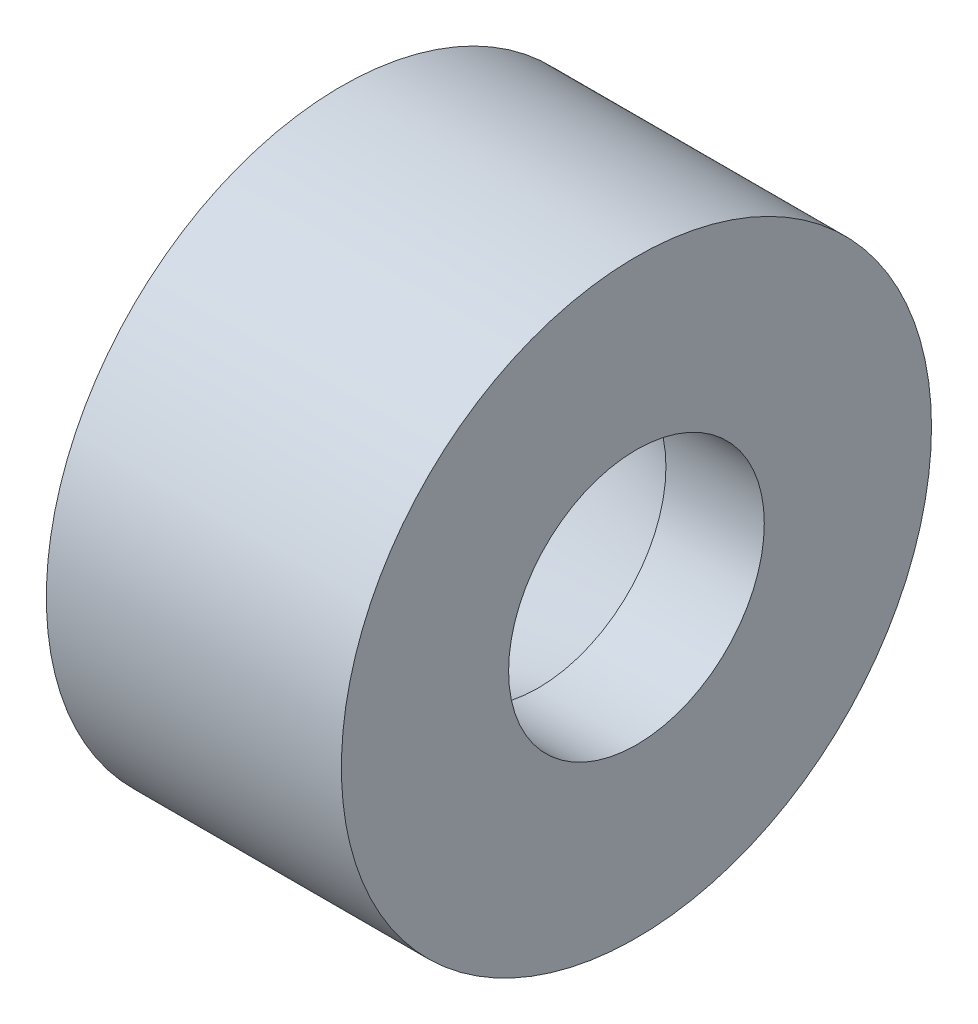
ISO-10303-21;
HEADER;
FILE_DESCRIPTION(('STEP AP214'),'2;1');
FILE_NAME('part.step','',(''),(''),'','','');
FILE_SCHEMA(('AUTOMOTIVE_DESIGN { 1 0 10303 214 1 1 1 1 }'));
ENDSEC;
DATA;
#1=APPLICATION_CONTEXT('core data for automotive mechanical design processes');
#2=APPLICATION_PROTOCOL_DEFINITION('international standard','automotive_design',2000,#1);
#3=PRODUCT_CONTEXT('',#1,'mechanical');
#4=PRODUCT('Part','Part','',(#3));
#5=PRODUCT_RELATED_PRODUCT_CATEGORY('part','',(#4));
#6=PRODUCT_DEFINITION_FORMATION('','',#4);
#7=PRODUCT_DEFINITION_CONTEXT('part definition',#1,'design');
#8=PRODUCT_DEFINITION('design','',#6,#7);
#9=PRODUCT_DEFINITION_SHAPE('','',#8);
#10=(LENGTH_UNIT() NAMED_UNIT(*) SI_UNIT(.MILLI.,.METRE.));
#11=(NAMED_UNIT(*) PLANE_ANGLE_UNIT() SI_UNIT($,.RADIAN.));
#12=(NAMED_UNIT(*) SI_UNIT($,.STERADIAN.) SOLID_ANGLE_UNIT());
#13=UNCERTAINTY_MEASURE_WITH_UNIT(LENGTH_MEASURE(1.E-05),#10,'distance_accuracy_value','');
#14=(GEOMETRIC_REPRESENTATION_CONTEXT(3) GLOBAL_UNCERTAINTY_ASSIGNED_CONTEXT((#13)) GLOBAL_UNIT_ASSIGNED_CONTEXT((#10,
#11,#12)) REPRESENTATION_CONTEXT('',''));
#15=CARTESIAN_POINT('',(0.,0.,0.));
#16=DIRECTION('',(0.,0.,1.));
#17=DIRECTION('',(1.,0.,0.));
#18=AXIS2_PLACEMENT_3D('',#15,#16,#17);
#19=CARTESIAN_POINT('',(0.,15.,0.));
#20=DIRECTION('',(1.,0.,0.));
#21=DIRECTION('',(0.,0.,-1.));
#22=AXIS2_PLACEMENT_3D('',#19,#20,#21);
#23=PLANE('',#22);
#24=CARTESIAN_POINT('',(0.,0.,0.));
#25=DIRECTION('',(1.,0.,0.));
#26=DIRECTION('',(0.,0.,-1.));
#27=AXIS2_PLACEMENT_3D('',#24,#25,#26);
#28=CIRCLE('',#27,15.);
#29=CARTESIAN_POINT('',(0.,0.,-15.));
#30=VERTEX_POINT('',#29);
#31=EDGE_CURVE('E48',#30,#30,#28,.T.);
#32=ORIENTED_EDGE('',*,*,#31,.T.);
#33=EDGE_LOOP('',(#32));
#34=FACE_BOUND('',#33,.T.);
#35=CARTESIAN_POINT('',(0.,0.,0.));
#36=DIRECTION('',(1.,0.,0.));
#37=DIRECTION('',(0.,0.,-1.));
#38=AXIS2_PLACEMENT_3D('',#35,#36,#37);
#39=CIRCLE('',#38,6.5);
#40=CARTESIAN_POINT('',(0.,0.,-6.5));
#41=VERTEX_POINT('',#40);
#42=EDGE_CURVE('E10',#41,#41,#39,.T.);
#43=ORIENTED_EDGE('',*,*,#42,.F.);
#44=EDGE_LOOP('',(#43));
#45=FACE_BOUND('',#44,.T.);
#46=ADVANCED_FACE('F29',(#34,#45),#23,.T.);
#47=CARTESIAN_POINT('',(0.,0.,0.));
#48=DIRECTION('',(1.,0.,0.));
#49=DIRECTION('',(0.,0.,-1.));
#50=AXIS2_PLACEMENT_3D('',#47,#48,#49);
#51=CYLINDRICAL_SURFACE('',#50,6.5);
#52=ORIENTED_EDGE('',*,*,#42,.T.);
#53=EDGE_LOOP('',(#52));
#54=FACE_BOUND('',#53,.T.);
#55=CARTESIAN_POINT('',(-5.,0.,0.));
#56=DIRECTION('',(1.,0.,0.));
#57=DIRECTION('',(0.,0.,-1.));
#58=AXIS2_PLACEMENT_3D('',#55,#56,#57);
#59=CIRCLE('',#58,6.5);
#60=CARTESIAN_POINT('',(-5.,0.,-6.5));
#61=VERTEX_POINT('',#60);
#62=EDGE_CURVE('E35',#61,#61,#59,.T.);
#63=ORIENTED_EDGE('',*,*,#62,.F.);
#64=EDGE_LOOP('',(#63));
#65=FACE_BOUND('',#64,.T.);
#66=ADVANCED_FACE('F66',(#54,#65),#51,.F.);
#67=CARTESIAN_POINT('',(-15.,0.,0.));
#68=DIRECTION('',(-1.,0.,0.));
#69=DIRECTION('',(0.,0.,1.));
#70=AXIS2_PLACEMENT_3D('',#67,#68,#69);
#71=CONICAL_SURFACE('',#70,10.139702342662,0.349065850398867);
#72=ORIENTED_EDGE('',*,*,#62,.T.);
#73=EDGE_LOOP('',(#72));
#74=FACE_BOUND('',#73,.T.);
#75=CARTESIAN_POINT('',(-15.,0.,0.));
#76=DIRECTION('',(1.,0.,0.));
#77=DIRECTION('',(0.,0.,-1.));
#78=AXIS2_PLACEMENT_3D('',#75,#76,#77);
#79=CIRCLE('',#78,10.139702342662);
#80=CARTESIAN_POINT('',(-15.,0.,-10.139702342662));
#81=VERTEX_POINT('',#80);
#82=EDGE_CURVE('E39',#81,#81,#79,.T.);
#83=ORIENTED_EDGE('',*,*,#82,.F.);
#84=EDGE_LOOP('',(#83));
#85=FACE_BOUND('',#84,.T.);
#86=ADVANCED_FACE('F62',(#74,#85),#71,.F.);
#87=CARTESIAN_POINT('',(-15.,10.139702342662,0.));
#88=DIRECTION('',(-1.,0.,0.));
#89=DIRECTION('',(0.,0.,1.));
#90=AXIS2_PLACEMENT_3D('',#87,#88,#89);
#91=PLANE('',#90);
#92=ORIENTED_EDGE('',*,*,#82,.T.);
#93=EDGE_LOOP('',(#92));
#94=FACE_BOUND('',#93,.T.);
#95=CARTESIAN_POINT('',(-15.,0.,0.));
#96=DIRECTION('',(1.,0.,0.));
#97=DIRECTION('',(0.,0.,-1.));
#98=AXIS2_PLACEMENT_3D('',#95,#96,#97);
#99=CIRCLE('',#98,15.);
#100=CARTESIAN_POINT('',(-15.,0.,-15.));
#101=VERTEX_POINT('',#100);
#102=EDGE_CURVE('E43',#101,#101,#99,.T.);
#103=ORIENTED_EDGE('',*,*,#102,.F.);
#104=EDGE_LOOP('',(#103));
#105=FACE_BOUND('',#104,.T.);
#106=ADVANCED_FACE('F56',(#94,#105),#91,.T.);
#107=CARTESIAN_POINT('',(0.,0.,0.));
#108=DIRECTION('',(1.,0.,0.));
#109=DIRECTION('',(0.,0.,-1.));
#110=AXIS2_PLACEMENT_3D('',#107,#108,#109);
#111=CYLINDRICAL_SURFACE('',#110,15.);
#112=ORIENTED_EDGE('',*,*,#102,.T.);
#113=EDGE_LOOP('',(#112));
#114=FACE_BOUND('',#113,.T.);
#115=ORIENTED_EDGE('',*,*,#31,.F.);
#116=EDGE_LOOP('',(#115));
#117=FACE_BOUND('',#116,.T.);
#118=ADVANCED_FACE('F54',(#114,#117),#111,.T.);
#119=CLOSED_SHELL('',(#46,#66,#86,#106,#118));
#120=MANIFOLD_SOLID_BREP('B2',#119);
#121=ADVANCED_BREP_SHAPE_REPRESENTATION('',(#18,#120),#14);
#122=SHAPE_DEFINITION_REPRESENTATION(#9,#121);
ENDSEC;
END-ISO-10303-21;
